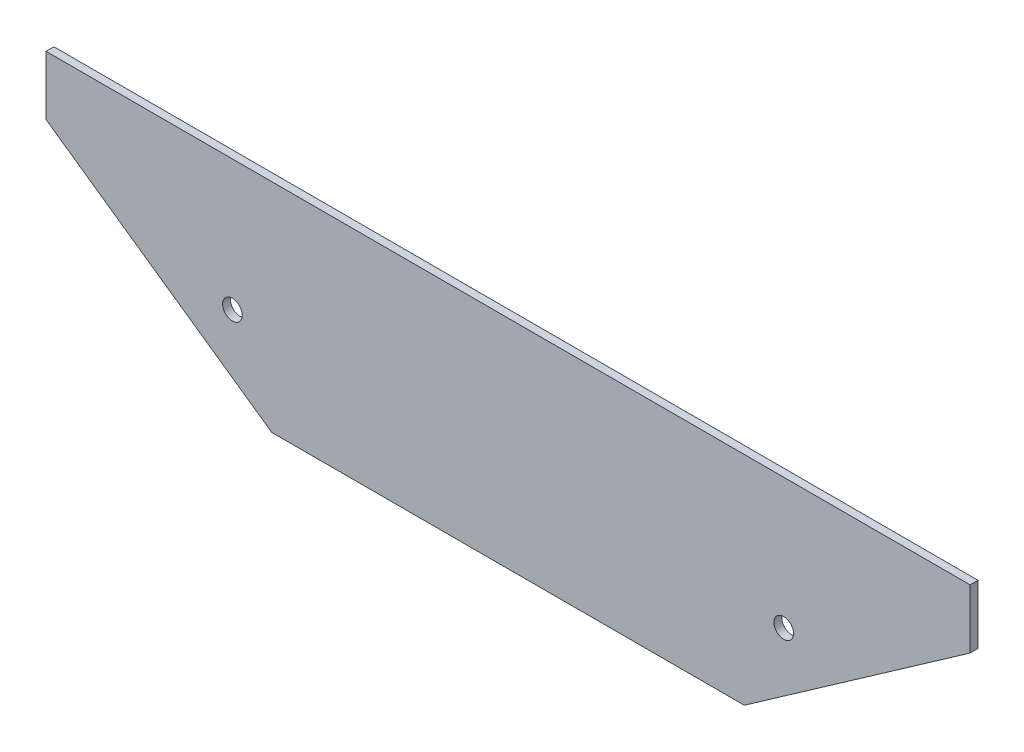
ISO-10303-21;
HEADER;
FILE_DESCRIPTION(('STEP AP214'),'2;1');
FILE_NAME('part.step','',(''),(''),'','','');
FILE_SCHEMA(('AUTOMOTIVE_DESIGN { 1 0 10303 214 1 1 1 1 }'));
ENDSEC;
DATA;
#1=APPLICATION_CONTEXT('core data for automotive mechanical design processes');
#2=APPLICATION_PROTOCOL_DEFINITION('international standard','automotive_design',2000,#1);
#3=PRODUCT_CONTEXT('',#1,'mechanical');
#4=PRODUCT('Part','Part','',(#3));
#5=PRODUCT_RELATED_PRODUCT_CATEGORY('part','',(#4));
#6=PRODUCT_DEFINITION_FORMATION('','',#4);
#7=PRODUCT_DEFINITION_CONTEXT('part definition',#1,'design');
#8=PRODUCT_DEFINITION('design','',#6,#7);
#9=PRODUCT_DEFINITION_SHAPE('','',#8);
#10=(LENGTH_UNIT() NAMED_UNIT(*) SI_UNIT(.MILLI.,.METRE.));
#11=(NAMED_UNIT(*) PLANE_ANGLE_UNIT() SI_UNIT($,.RADIAN.));
#12=(NAMED_UNIT(*) SI_UNIT($,.STERADIAN.) SOLID_ANGLE_UNIT());
#13=UNCERTAINTY_MEASURE_WITH_UNIT(LENGTH_MEASURE(1.E-05),#10,'distance_accuracy_value','');
#14=(GEOMETRIC_REPRESENTATION_CONTEXT(3) GLOBAL_UNCERTAINTY_ASSIGNED_CONTEXT((#13)) GLOBAL_UNIT_ASSIGNED_CONTEXT((#10,
#11,#12)) REPRESENTATION_CONTEXT('',''));
#15=CARTESIAN_POINT('',(0.,0.,0.));
#16=DIRECTION('',(0.,0.,1.));
#17=DIRECTION('',(1.,0.,0.));
#18=AXIS2_PLACEMENT_3D('',#15,#16,#17);
#19=CARTESIAN_POINT('',(0.,-63.7477301012441,94.));
#20=DIRECTION('',(0.,1.,0.));
#21=DIRECTION('',(0.,0.,1.));
#22=AXIS2_PLACEMENT_3D('',#19,#20,#21);
#23=PLANE('',#22);
#24=DIRECTION('',(1.,0.,0.));
#25=VECTOR('',#24,1.);
#26=CARTESIAN_POINT('',(0.,-63.7477301012441,92.));
#27=LINE('',#26,#25);
#28=CARTESIAN_POINT('',(183.065028698906,-63.7477301012441,92.));
#29=VERTEX_POINT('',#28);
#30=CARTESIAN_POINT('',(303.065028698906,-63.7477301012441,92.));
#31=VERTEX_POINT('',#30);
#32=EDGE_CURVE('E133',#29,#31,#27,.T.);
#33=ORIENTED_EDGE('',*,*,#32,.T.);
#34=DIRECTION('',(0.,0.,-1.));
#35=VECTOR('',#34,1.);
#36=CARTESIAN_POINT('',(303.065028698906,-63.7477301012441,102.));
#37=LINE('',#36,#35);
#38=CARTESIAN_POINT('',(303.065028698906,-63.7477301012441,94.));
#39=VERTEX_POINT('',#38);
#40=EDGE_CURVE('E58',#39,#31,#37,.T.);
#41=ORIENTED_EDGE('',*,*,#40,.F.);
#42=DIRECTION('',(1.,0.,0.));
#43=VECTOR('',#42,1.);
#44=CARTESIAN_POINT('',(0.,-63.7477301012441,94.));
#45=LINE('',#44,#43);
#46=CARTESIAN_POINT('',(183.065028698906,-63.7477301012441,94.));
#47=VERTEX_POINT('',#46);
#48=EDGE_CURVE('E134',#47,#39,#45,.T.);
#49=ORIENTED_EDGE('',*,*,#48,.F.);
#50=DIRECTION('',(0.,0.,-1.));
#51=VECTOR('',#50,1.);
#52=CARTESIAN_POINT('',(183.065028698906,-63.7477301012441,102.));
#53=LINE('',#52,#51);
#54=EDGE_CURVE('E121',#47,#29,#53,.T.);
#55=ORIENTED_EDGE('',*,*,#54,.T.);
#56=EDGE_LOOP('',(#33,#41,#49,#55));
#57=FACE_BOUND('',#56,.T.);
#58=ADVANCED_FACE('F34',(#57),#23,.F.);
#59=CARTESIAN_POINT('',(0.,-8.59737955667109,94.));
#60=DIRECTION('',(0.,1.,0.));
#61=DIRECTION('',(0.,0.,1.));
#62=AXIS2_PLACEMENT_3D('',#59,#60,#61);
#63=PLANE('',#62);
#64=DIRECTION('',(0.,0.,-1.));
#65=VECTOR('',#64,1.);
#66=CARTESIAN_POINT('',(360.405671799136,-8.59737955667109,102.));
#67=LINE('',#66,#65);
#68=CARTESIAN_POINT('',(360.405671799136,-8.59737955667109,94.));
#69=VERTEX_POINT('',#68);
#70=CARTESIAN_POINT('',(360.405671799136,-8.59737955667109,92.));
#71=VERTEX_POINT('',#70);
#72=EDGE_CURVE('E97',#69,#71,#67,.T.);
#73=ORIENTED_EDGE('',*,*,#72,.T.);
#74=DIRECTION('',(1.,0.,0.));
#75=VECTOR('',#74,1.);
#76=CARTESIAN_POINT('',(0.,-8.59737955667109,92.));
#77=LINE('',#76,#75);
#78=CARTESIAN_POINT('',(125.724385598677,-8.59737955667109,92.));
#79=VERTEX_POINT('',#78);
#80=EDGE_CURVE('E109',#79,#71,#77,.T.);
#81=ORIENTED_EDGE('',*,*,#80,.F.);
#82=DIRECTION('',(0.,0.,-1.));
#83=VECTOR('',#82,1.);
#84=CARTESIAN_POINT('',(125.724385598677,-8.59737955667109,102.));
#85=LINE('',#84,#83);
#86=CARTESIAN_POINT('',(125.724385598677,-8.59737955667109,94.));
#87=VERTEX_POINT('',#86);
#88=EDGE_CURVE('E104',#87,#79,#85,.T.);
#89=ORIENTED_EDGE('',*,*,#88,.F.);
#90=DIRECTION('',(1.,0.,0.));
#91=VECTOR('',#90,1.);
#92=CARTESIAN_POINT('',(0.,-8.59737955667109,94.));
#93=LINE('',#92,#91);
#94=EDGE_CURVE('E137',#87,#69,#93,.T.);
#95=ORIENTED_EDGE('',*,*,#94,.T.);
#96=EDGE_LOOP('',(#73,#81,#89,#95));
#97=FACE_BOUND('',#96,.T.);
#98=ADVANCED_FACE('F162',(#97),#63,.T.);
#99=CARTESIAN_POINT('',(0.,0.,94.));
#100=DIRECTION('',(0.,0.,1.));
#101=DIRECTION('',(1.,0.,0.));
#102=AXIS2_PLACEMENT_3D('',#99,#100,#101);
#103=PLANE('',#102);
#104=DIRECTION('',(0.,-1.,0.));
#105=VECTOR('',#104,1.);
#106=CARTESIAN_POINT('',(360.405671799136,0.,94.));
#107=LINE('',#106,#105);
#108=CARTESIAN_POINT('',(360.405671799136,-23.5973795566708,94.));
#109=VERTEX_POINT('',#108);
#110=EDGE_CURVE('E95',#69,#109,#107,.T.);
#111=ORIENTED_EDGE('',*,*,#110,.F.);
#112=ORIENTED_EDGE('',*,*,#94,.F.);
#113=DIRECTION('',(0.,-1.,0.));
#114=VECTOR('',#113,1.);
#115=CARTESIAN_POINT('',(125.724385598676,6.04855799810178E-12,94.));
#116=LINE('',#115,#114);
#117=CARTESIAN_POINT('',(125.724385598678,-23.5973795566711,94.));
#118=VERTEX_POINT('',#117);
#119=EDGE_CURVE('E127',#87,#118,#116,.T.);
#120=ORIENTED_EDGE('',*,*,#119,.T.);
#121=DIRECTION('',(0.81915204428899,-0.573576436351048,0.));
#122=VECTOR('',#121,1.);
#123=CARTESIAN_POINT('',(30.2749148886993,43.2370593525829,94.));
#124=LINE('',#123,#122);
#125=EDGE_CURVE('E113',#118,#47,#124,.T.);
#126=ORIENTED_EDGE('',*,*,#125,.T.);
#127=ORIENTED_EDGE('',*,*,#48,.T.);
#128=DIRECTION('',(-0.819152044288994,-0.573576436351044,0.));
#129=VECTOR('',#128,1.);
#130=CARTESIAN_POINT('',(129.656977857149,-185.169354486895,94.));
#131=LINE('',#130,#129);
#132=EDGE_CURVE('E130',#109,#39,#131,.T.);
#133=ORIENTED_EDGE('',*,*,#132,.F.);
#134=EDGE_LOOP('',(#111,#112,#120,#126,#127,#133));
#135=FACE_BOUND('',#134,.T.);
#136=CARTESIAN_POINT('',(313.065028698906,-41.7477301012441,94.));
#137=DIRECTION('',(0.,0.,1.));
#138=DIRECTION('',(1.,0.,0.));
#139=AXIS2_PLACEMENT_3D('',#136,#137,#138);
#140=CIRCLE('',#139,2.50000000000002);
#141=CARTESIAN_POINT('',(315.565028698906,-41.7477301012441,94.));
#142=VERTEX_POINT('',#141);
#143=EDGE_CURVE('E42',#142,#142,#140,.T.);
#144=ORIENTED_EDGE('',*,*,#143,.F.);
#145=EDGE_LOOP('',(#144));
#146=FACE_BOUND('',#145,.T.);
#147=CARTESIAN_POINT('',(173.065028698906,-41.7477301012442,94.));
#148=DIRECTION('',(0.,0.,1.));
#149=DIRECTION('',(1.,0.,0.));
#150=AXIS2_PLACEMENT_3D('',#147,#148,#149);
#151=CIRCLE('',#150,2.50000000000002);
#152=CARTESIAN_POINT('',(175.565028698906,-41.7477301012442,94.));
#153=VERTEX_POINT('',#152);
#154=EDGE_CURVE('E11',#153,#153,#151,.F.);
#155=ORIENTED_EDGE('',*,*,#154,.T.);
#156=EDGE_LOOP('',(#155));
#157=FACE_BOUND('',#156,.T.);
#158=ADVANCED_FACE('F154',(#135,#146,#157),#103,.T.);
#159=CARTESIAN_POINT('',(0.,0.,92.));
#160=DIRECTION('',(0.,0.,1.));
#161=DIRECTION('',(1.,0.,0.));
#162=AXIS2_PLACEMENT_3D('',#159,#160,#161);
#163=PLANE('',#162);
#164=CARTESIAN_POINT('',(173.065028698906,-41.7477301012442,92.));
#165=DIRECTION('',(0.,0.,1.));
#166=DIRECTION('',(1.,0.,0.));
#167=AXIS2_PLACEMENT_3D('',#164,#165,#166);
#168=CIRCLE('',#167,2.50000000000002);
#169=CARTESIAN_POINT('',(175.565028698906,-41.7477301012442,92.));
#170=VERTEX_POINT('',#169);
#171=EDGE_CURVE('E37',#170,#170,#168,.F.);
#172=ORIENTED_EDGE('',*,*,#171,.F.);
#173=EDGE_LOOP('',(#172));
#174=FACE_BOUND('',#173,.T.);
#175=CARTESIAN_POINT('',(313.065028698906,-41.7477301012441,92.));
#176=DIRECTION('',(0.,0.,1.));
#177=DIRECTION('',(1.,0.,0.));
#178=AXIS2_PLACEMENT_3D('',#175,#176,#177);
#179=CIRCLE('',#178,2.50000000000002);
#180=CARTESIAN_POINT('',(315.565028698906,-41.7477301012441,92.));
#181=VERTEX_POINT('',#180);
#182=EDGE_CURVE('E143',#181,#181,#179,.T.);
#183=ORIENTED_EDGE('',*,*,#182,.T.);
#184=EDGE_LOOP('',(#183));
#185=FACE_BOUND('',#184,.T.);
#186=ORIENTED_EDGE('',*,*,#80,.T.);
#187=DIRECTION('',(0.,1.,0.));
#188=VECTOR('',#187,1.);
#189=CARTESIAN_POINT('',(360.405671799136,0.,92.));
#190=LINE('',#189,#188);
#191=CARTESIAN_POINT('',(360.405671799136,-23.5973795566708,92.));
#192=VERTEX_POINT('',#191);
#193=EDGE_CURVE('E92',#192,#71,#190,.T.);
#194=ORIENTED_EDGE('',*,*,#193,.F.);
#195=DIRECTION('',(0.819152044288994,0.573576436351044,0.));
#196=VECTOR('',#195,1.);
#197=CARTESIAN_POINT('',(129.656977857149,-185.169354486895,92.));
#198=LINE('',#197,#196);
#199=EDGE_CURVE('E99',#31,#192,#198,.T.);
#200=ORIENTED_EDGE('',*,*,#199,.F.);
#201=ORIENTED_EDGE('',*,*,#32,.F.);
#202=DIRECTION('',(-0.81915204428899,0.573576436351048,0.));
#203=VECTOR('',#202,1.);
#204=CARTESIAN_POINT('',(30.2749148886994,43.2370593525829,92.));
#205=LINE('',#204,#203);
#206=CARTESIAN_POINT('',(125.724385598678,-23.5973795566711,92.));
#207=VERTEX_POINT('',#206);
#208=EDGE_CURVE('E116',#29,#207,#205,.T.);
#209=ORIENTED_EDGE('',*,*,#208,.T.);
#210=DIRECTION('',(0.,1.,0.));
#211=VECTOR('',#210,1.);
#212=CARTESIAN_POINT('',(125.724385598676,6.04855799810178E-12,92.));
#213=LINE('',#212,#211);
#214=EDGE_CURVE('E50',#207,#79,#213,.T.);
#215=ORIENTED_EDGE('',*,*,#214,.T.);
#216=EDGE_LOOP('',(#186,#194,#200,#201,#209,#215));
#217=FACE_BOUND('',#216,.T.);
#218=ADVANCED_FACE('F107',(#174,#185,#217),#163,.F.);
#219=CARTESIAN_POINT('',(313.065028698906,-41.7477301012441,94.));
#220=DIRECTION('',(0.,0.,-1.));
#221=DIRECTION('',(-1.,0.,0.));
#222=AXIS2_PLACEMENT_3D('',#219,#220,#221);
#223=CYLINDRICAL_SURFACE('',#222,2.50000000000002);
#224=ORIENTED_EDGE('',*,*,#143,.T.);
#225=EDGE_LOOP('',(#224));
#226=FACE_BOUND('',#225,.T.);
#227=ORIENTED_EDGE('',*,*,#182,.F.);
#228=EDGE_LOOP('',(#227));
#229=FACE_BOUND('',#228,.T.);
#230=ADVANCED_FACE('F153',(#226,#229),#223,.F.);
#231=CARTESIAN_POINT('',(173.065028698906,-41.7477301012442,94.));
#232=DIRECTION('',(0.,0.,-1.));
#233=DIRECTION('',(-1.,0.,0.));
#234=AXIS2_PLACEMENT_3D('',#231,#232,#233);
#235=CYLINDRICAL_SURFACE('',#234,2.50000000000002);
#236=ORIENTED_EDGE('',*,*,#154,.F.);
#237=EDGE_LOOP('',(#236));
#238=FACE_BOUND('',#237,.T.);
#239=ORIENTED_EDGE('',*,*,#171,.T.);
#240=EDGE_LOOP('',(#239));
#241=FACE_BOUND('',#240,.T.);
#242=ADVANCED_FACE('F150',(#238,#241),#235,.F.);
#243=CARTESIAN_POINT('',(125.724385598676,6.04855799810178E-12,102.));
#244=DIRECTION('',(-1.,0.,0.));
#245=DIRECTION('',(0.,-1.,0.));
#246=AXIS2_PLACEMENT_3D('',#243,#244,#245);
#247=PLANE('',#246);
#248=ORIENTED_EDGE('',*,*,#88,.T.);
#249=ORIENTED_EDGE('',*,*,#214,.F.);
#250=DIRECTION('',(0.,0.,-1.));
#251=VECTOR('',#250,1.);
#252=CARTESIAN_POINT('',(125.724385598678,-23.5973795566711,102.));
#253=LINE('',#252,#251);
#254=EDGE_CURVE('E119',#118,#207,#253,.T.);
#255=ORIENTED_EDGE('',*,*,#254,.F.);
#256=ORIENTED_EDGE('',*,*,#119,.F.);
#257=EDGE_LOOP('',(#248,#249,#255,#256));
#258=FACE_BOUND('',#257,.T.);
#259=ADVANCED_FACE('F175',(#258),#247,.T.);
#260=CARTESIAN_POINT('',(30.2749148886994,43.2370593525829,102.));
#261=DIRECTION('',(-0.573576436351048,-0.81915204428899,0.));
#262=DIRECTION('',(0.81915204428899,-0.573576436351048,0.));
#263=AXIS2_PLACEMENT_3D('',#260,#261,#262);
#264=PLANE('',#263);
#265=ORIENTED_EDGE('',*,*,#254,.T.);
#266=ORIENTED_EDGE('',*,*,#208,.F.);
#267=ORIENTED_EDGE('',*,*,#54,.F.);
#268=ORIENTED_EDGE('',*,*,#125,.F.);
#269=EDGE_LOOP('',(#265,#266,#267,#268));
#270=FACE_BOUND('',#269,.T.);
#271=ADVANCED_FACE('F174',(#270),#264,.T.);
#272=CARTESIAN_POINT('',(360.405671799136,0.,102.));
#273=DIRECTION('',(-1.,0.,0.));
#274=DIRECTION('',(0.,0.,1.));
#275=AXIS2_PLACEMENT_3D('',#272,#273,#274);
#276=PLANE('',#275);
#277=ORIENTED_EDGE('',*,*,#110,.T.);
#278=DIRECTION('',(0.,0.,-1.));
#279=VECTOR('',#278,1.);
#280=CARTESIAN_POINT('',(360.405671799136,-23.5973795566708,102.));
#281=LINE('',#280,#279);
#282=EDGE_CURVE('E89',#109,#192,#281,.T.);
#283=ORIENTED_EDGE('',*,*,#282,.T.);
#284=ORIENTED_EDGE('',*,*,#193,.T.);
#285=ORIENTED_EDGE('',*,*,#72,.F.);
#286=EDGE_LOOP('',(#277,#283,#284,#285));
#287=FACE_BOUND('',#286,.T.);
#288=ADVANCED_FACE('F90',(#287),#276,.F.);
#289=CARTESIAN_POINT('',(129.656977857149,-185.169354486895,102.));
#290=DIRECTION('',(-0.573576436351044,0.819152044288994,0.));
#291=DIRECTION('',(-0.819152044288994,-0.573576436351044,0.));
#292=AXIS2_PLACEMENT_3D('',#289,#290,#291);
#293=PLANE('',#292);
#294=ORIENTED_EDGE('',*,*,#132,.T.);
#295=ORIENTED_EDGE('',*,*,#40,.T.);
#296=ORIENTED_EDGE('',*,*,#199,.T.);
#297=ORIENTED_EDGE('',*,*,#282,.F.);
#298=EDGE_LOOP('',(#294,#295,#296,#297));
#299=FACE_BOUND('',#298,.T.);
#300=ADVANCED_FACE('F100',(#299),#293,.F.);
#301=CLOSED_SHELL('',(#58,#98,#158,#218,#230,#242,#259,#271,#288,#300));
#302=MANIFOLD_SOLID_BREP('B2',#301);
#303=ADVANCED_BREP_SHAPE_REPRESENTATION('',(#18,#302),#14);
#304=SHAPE_DEFINITION_REPRESENTATION(#9,#303);
ENDSEC;
END-ISO-10303-21;
